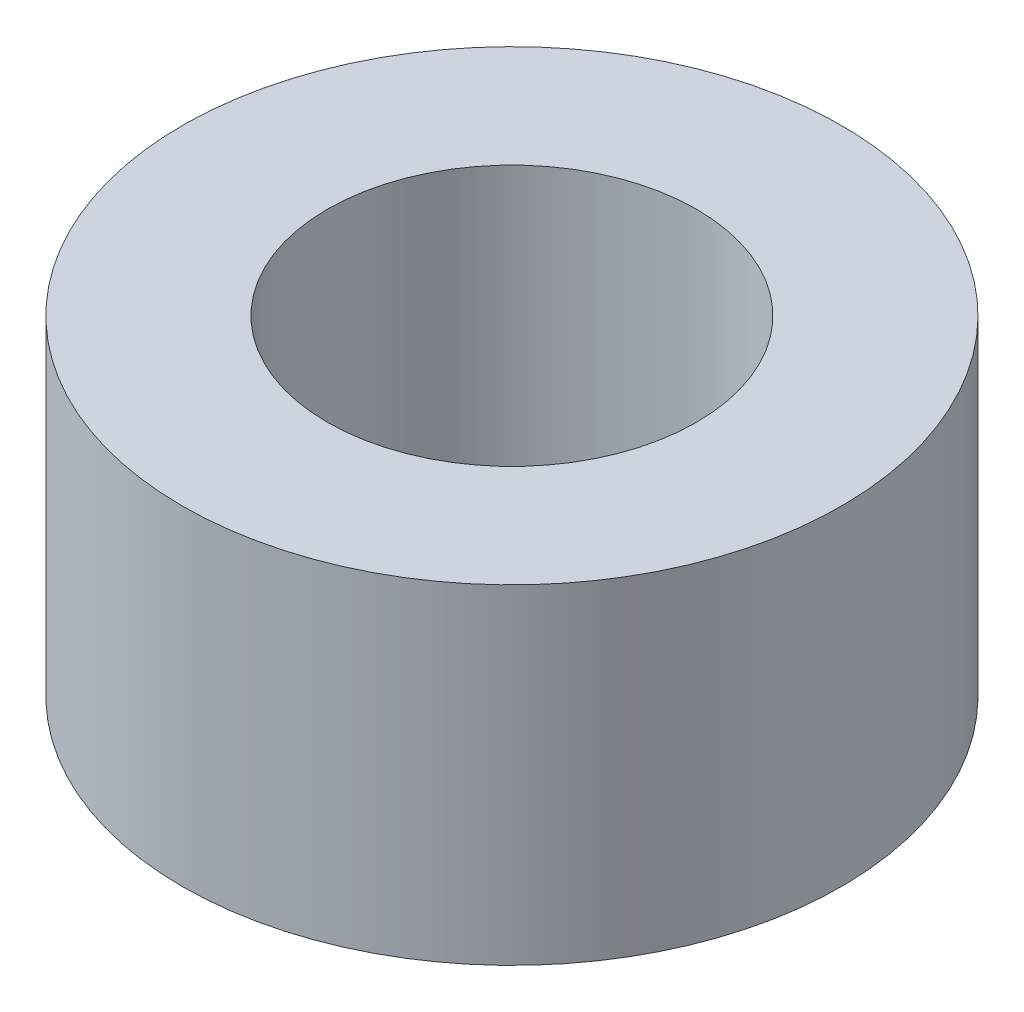
ISO-10303-21;
HEADER;
FILE_DESCRIPTION(('STEP AP214'),'2;1');
FILE_NAME('part.step','',(''),(''),'','','');
FILE_SCHEMA(('AUTOMOTIVE_DESIGN { 1 0 10303 214 1 1 1 1 }'));
ENDSEC;
DATA;
#1=APPLICATION_CONTEXT('core data for automotive mechanical design processes');
#2=APPLICATION_PROTOCOL_DEFINITION('international standard','automotive_design',2000,#1);
#3=PRODUCT_CONTEXT('',#1,'mechanical');
#4=PRODUCT('Part','Part','',(#3));
#5=PRODUCT_RELATED_PRODUCT_CATEGORY('part','',(#4));
#6=PRODUCT_DEFINITION_FORMATION('','',#4);
#7=PRODUCT_DEFINITION_CONTEXT('part definition',#1,'design');
#8=PRODUCT_DEFINITION('design','',#6,#7);
#9=PRODUCT_DEFINITION_SHAPE('','',#8);
#10=(LENGTH_UNIT() NAMED_UNIT(*) SI_UNIT(.MILLI.,.METRE.));
#11=(NAMED_UNIT(*) PLANE_ANGLE_UNIT() SI_UNIT($,.RADIAN.));
#12=(NAMED_UNIT(*) SI_UNIT($,.STERADIAN.) SOLID_ANGLE_UNIT());
#13=UNCERTAINTY_MEASURE_WITH_UNIT(LENGTH_MEASURE(1.E-05),#10,'distance_accuracy_value','');
#14=(GEOMETRIC_REPRESENTATION_CONTEXT(3) GLOBAL_UNCERTAINTY_ASSIGNED_CONTEXT((#13)) GLOBAL_UNIT_ASSIGNED_CONTEXT((#10,
#11,#12)) REPRESENTATION_CONTEXT('',''));
#15=CARTESIAN_POINT('',(0.,0.,0.));
#16=DIRECTION('',(0.,0.,1.));
#17=DIRECTION('',(1.,0.,0.));
#18=AXIS2_PLACEMENT_3D('',#15,#16,#17);
#19=CARTESIAN_POINT('',(0.,3.175,0.));
#20=DIRECTION('',(0.,-1.,0.));
#21=DIRECTION('',(0.,0.,-1.));
#22=AXIS2_PLACEMENT_3D('',#19,#20,#21);
#23=CYLINDRICAL_SURFACE('',#22,3.175);
#24=CARTESIAN_POINT('',(0.,3.175,0.));
#25=DIRECTION('',(0.,1.,0.));
#26=DIRECTION('',(0.,0.,1.));
#27=AXIS2_PLACEMENT_3D('',#24,#25,#26);
#28=CIRCLE('',#27,3.175);
#29=CARTESIAN_POINT('',(0.,3.175,3.175));
#30=VERTEX_POINT('',#29);
#31=EDGE_CURVE('E10',#30,#30,#28,.T.);
#32=ORIENTED_EDGE('',*,*,#31,.F.);
#33=EDGE_LOOP('',(#32));
#34=FACE_BOUND('',#33,.T.);
#35=CARTESIAN_POINT('',(0.,0.,0.));
#36=DIRECTION('',(0.,1.,0.));
#37=DIRECTION('',(0.,0.,1.));
#38=AXIS2_PLACEMENT_3D('',#35,#36,#37);
#39=CIRCLE('',#38,3.175);
#40=CARTESIAN_POINT('',(0.,0.,3.175));
#41=VERTEX_POINT('',#40);
#42=EDGE_CURVE('E34',#41,#41,#39,.T.);
#43=ORIENTED_EDGE('',*,*,#42,.T.);
#44=EDGE_LOOP('',(#43));
#45=FACE_BOUND('',#44,.T.);
#46=ADVANCED_FACE('F31',(#34,#45),#23,.T.);
#47=CARTESIAN_POINT('',(0.,3.175,0.));
#48=DIRECTION('',(0.,1.,0.));
#49=DIRECTION('',(0.,0.,1.));
#50=AXIS2_PLACEMENT_3D('',#47,#48,#49);
#51=PLANE('',#50);
#52=CARTESIAN_POINT('',(0.,3.175,0.));
#53=DIRECTION('',(0.,1.,0.));
#54=DIRECTION('',(0.,0.,1.));
#55=AXIS2_PLACEMENT_3D('',#52,#53,#54);
#56=CIRCLE('',#55,1.778);
#57=CARTESIAN_POINT('',(0.,3.175,1.778));
#58=VERTEX_POINT('',#57);
#59=EDGE_CURVE('E43',#58,#58,#56,.T.);
#60=ORIENTED_EDGE('',*,*,#59,.F.);
#61=EDGE_LOOP('',(#60));
#62=FACE_BOUND('',#61,.T.);
#63=ORIENTED_EDGE('',*,*,#31,.T.);
#64=EDGE_LOOP('',(#63));
#65=FACE_BOUND('',#64,.T.);
#66=ADVANCED_FACE('F58',(#62,#65),#51,.T.);
#67=CARTESIAN_POINT('',(0.,0.,0.));
#68=DIRECTION('',(0.,1.,0.));
#69=DIRECTION('',(0.,0.,1.));
#70=AXIS2_PLACEMENT_3D('',#67,#68,#69);
#71=PLANE('',#70);
#72=CARTESIAN_POINT('',(0.,0.,0.));
#73=DIRECTION('',(0.,1.,0.));
#74=DIRECTION('',(0.,0.,1.));
#75=AXIS2_PLACEMENT_3D('',#72,#73,#74);
#76=CIRCLE('',#75,1.778);
#77=CARTESIAN_POINT('',(0.,0.,1.778));
#78=VERTEX_POINT('',#77);
#79=EDGE_CURVE('E41',#78,#78,#76,.T.);
#80=ORIENTED_EDGE('',*,*,#79,.T.);
#81=EDGE_LOOP('',(#80));
#82=FACE_BOUND('',#81,.T.);
#83=ORIENTED_EDGE('',*,*,#42,.F.);
#84=EDGE_LOOP('',(#83));
#85=FACE_BOUND('',#84,.T.);
#86=ADVANCED_FACE('F49',(#82,#85),#71,.F.);
#87=CARTESIAN_POINT('',(0.,0.,0.));
#88=DIRECTION('',(0.,1.,0.));
#89=DIRECTION('',(0.,0.,1.));
#90=AXIS2_PLACEMENT_3D('',#87,#88,#89);
#91=CYLINDRICAL_SURFACE('',#90,1.778);
#92=ORIENTED_EDGE('',*,*,#79,.F.);
#93=EDGE_LOOP('',(#92));
#94=FACE_BOUND('',#93,.T.);
#95=ORIENTED_EDGE('',*,*,#59,.T.);
#96=EDGE_LOOP('',(#95));
#97=FACE_BOUND('',#96,.T.);
#98=ADVANCED_FACE('F52',(#94,#97),#91,.F.);
#99=CLOSED_SHELL('',(#46,#66,#86,#98));
#100=MANIFOLD_SOLID_BREP('B2',#99);
#101=ADVANCED_BREP_SHAPE_REPRESENTATION('',(#18,#100),#14);
#102=SHAPE_DEFINITION_REPRESENTATION(#9,#101);
ENDSEC;
END-ISO-10303-21;
